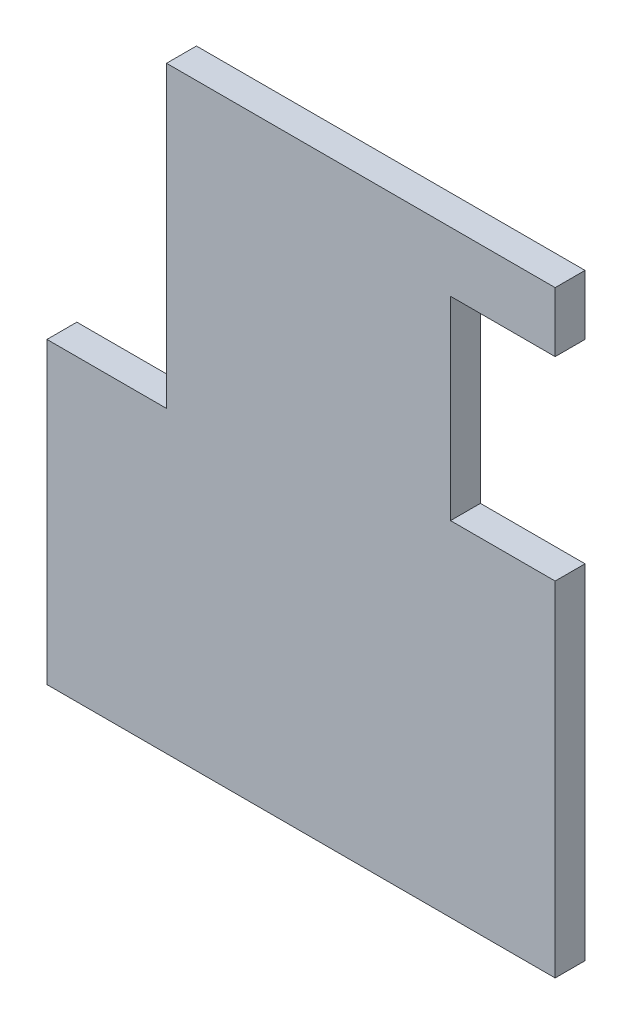
ISO-10303-21;
HEADER;
FILE_DESCRIPTION(('STEP AP214'),'2;1');
FILE_NAME('part.step','',(''),(''),'','','');
FILE_SCHEMA(('AUTOMOTIVE_DESIGN { 1 0 10303 214 1 1 1 1 }'));
ENDSEC;
DATA;
#1=APPLICATION_CONTEXT('core data for automotive mechanical design processes');
#2=APPLICATION_PROTOCOL_DEFINITION('international standard','automotive_design',2000,#1);
#3=PRODUCT_CONTEXT('',#1,'mechanical');
#4=PRODUCT('Part','Part','',(#3));
#5=PRODUCT_RELATED_PRODUCT_CATEGORY('part','',(#4));
#6=PRODUCT_DEFINITION_FORMATION('','',#4);
#7=PRODUCT_DEFINITION_CONTEXT('part definition',#1,'design');
#8=PRODUCT_DEFINITION('design','',#6,#7);
#9=PRODUCT_DEFINITION_SHAPE('','',#8);
#10=(LENGTH_UNIT() NAMED_UNIT(*) SI_UNIT(.MILLI.,.METRE.));
#11=(NAMED_UNIT(*) PLANE_ANGLE_UNIT() SI_UNIT($,.RADIAN.));
#12=(NAMED_UNIT(*) SI_UNIT($,.STERADIAN.) SOLID_ANGLE_UNIT());
#13=UNCERTAINTY_MEASURE_WITH_UNIT(LENGTH_MEASURE(1.E-05),#10,'distance_accuracy_value','');
#14=(GEOMETRIC_REPRESENTATION_CONTEXT(3) GLOBAL_UNCERTAINTY_ASSIGNED_CONTEXT((#13)) GLOBAL_UNIT_ASSIGNED_CONTEXT((#10,
#11,#12)) REPRESENTATION_CONTEXT('',''));
#15=CARTESIAN_POINT('',(0.,0.,0.));
#16=DIRECTION('',(0.,0.,1.));
#17=DIRECTION('',(1.,0.,0.));
#18=AXIS2_PLACEMENT_3D('',#15,#16,#17);
#19=CARTESIAN_POINT('',(-89.0927515243903,70.5572957317073,10.));
#20=DIRECTION('',(1.,0.,0.));
#21=DIRECTION('',(0.,1.,0.));
#22=AXIS2_PLACEMENT_3D('',#19,#20,#21);
#23=PLANE('',#22);
#24=DIRECTION('',(0.,-1.,0.));
#25=VECTOR('',#24,1.);
#26=CARTESIAN_POINT('',(-89.0927515243903,70.5572957317073,0.));
#27=LINE('',#26,#25);
#28=CARTESIAN_POINT('',(-89.0927515243903,70.5572957317073,0.));
#29=VERTEX_POINT('',#28);
#30=CARTESIAN_POINT('',(-89.0927515243903,-29.4427042682927,0.));
#31=VERTEX_POINT('',#30);
#32=EDGE_CURVE('E141',#29,#31,#27,.T.);
#33=ORIENTED_EDGE('',*,*,#32,.T.);
#34=DIRECTION('',(0.,0.,-1.));
#35=VECTOR('',#34,1.);
#36=CARTESIAN_POINT('',(-89.0927515243903,-29.4427042682927,10.));
#37=LINE('',#36,#35);
#38=CARTESIAN_POINT('',(-89.0927515243903,-29.4427042682927,10.));
#39=VERTEX_POINT('',#38);
#40=EDGE_CURVE('E11',#39,#31,#37,.T.);
#41=ORIENTED_EDGE('',*,*,#40,.F.);
#42=DIRECTION('',(0.,-1.,0.));
#43=VECTOR('',#42,1.);
#44=CARTESIAN_POINT('',(-89.0927515243903,70.5572957317073,10.));
#45=LINE('',#44,#43);
#46=CARTESIAN_POINT('',(-89.0927515243903,70.5572957317073,10.));
#47=VERTEX_POINT('',#46);
#48=EDGE_CURVE('E159',#47,#39,#45,.T.);
#49=ORIENTED_EDGE('',*,*,#48,.F.);
#50=DIRECTION('',(0.,0.,-1.));
#51=VECTOR('',#50,1.);
#52=CARTESIAN_POINT('',(-89.0927515243903,70.5572957317073,10.));
#53=LINE('',#52,#51);
#54=EDGE_CURVE('E137',#47,#29,#53,.T.);
#55=ORIENTED_EDGE('',*,*,#54,.T.);
#56=EDGE_LOOP('',(#33,#41,#49,#55));
#57=FACE_BOUND('',#56,.T.);
#58=ADVANCED_FACE('F33',(#57),#23,.F.);
#59=CARTESIAN_POINT('',(-89.0927515243903,-29.4427042682927,10.));
#60=DIRECTION('',(0.,1.,0.));
#61=DIRECTION('',(0.,0.,1.));
#62=AXIS2_PLACEMENT_3D('',#59,#60,#61);
#63=PLANE('',#62);
#64=DIRECTION('',(1.,0.,0.));
#65=VECTOR('',#64,1.);
#66=CARTESIAN_POINT('',(-89.0927515243903,-29.4427042682927,0.));
#67=LINE('',#66,#65);
#68=CARTESIAN_POINT('',(80.9072484756098,-29.4427042682927,0.));
#69=VERTEX_POINT('',#68);
#70=EDGE_CURVE('E144',#31,#69,#67,.T.);
#71=ORIENTED_EDGE('',*,*,#70,.T.);
#72=DIRECTION('',(0.,0.,-1.));
#73=VECTOR('',#72,1.);
#74=CARTESIAN_POINT('',(80.9072484756098,-29.4427042682927,10.));
#75=LINE('',#74,#73);
#76=CARTESIAN_POINT('',(80.9072484756098,-29.4427042682927,10.));
#77=VERTEX_POINT('',#76);
#78=EDGE_CURVE('E41',#77,#69,#75,.T.);
#79=ORIENTED_EDGE('',*,*,#78,.F.);
#80=DIRECTION('',(1.,0.,0.));
#81=VECTOR('',#80,1.);
#82=CARTESIAN_POINT('',(-89.0927515243903,-29.4427042682927,10.));
#83=LINE('',#82,#81);
#84=EDGE_CURVE('E98',#39,#77,#83,.T.);
#85=ORIENTED_EDGE('',*,*,#84,.F.);
#86=ORIENTED_EDGE('',*,*,#40,.T.);
#87=EDGE_LOOP('',(#71,#79,#85,#86));
#88=FACE_BOUND('',#87,.T.);
#89=ADVANCED_FACE('F208',(#88),#63,.F.);
#90=CARTESIAN_POINT('',(80.9072484756098,-29.4427042682927,10.));
#91=DIRECTION('',(-1.,0.,0.));
#92=DIRECTION('',(0.,0.,1.));
#93=AXIS2_PLACEMENT_3D('',#90,#91,#92);
#94=PLANE('',#93);
#95=DIRECTION('',(0.,1.,0.));
#96=VECTOR('',#95,1.);
#97=CARTESIAN_POINT('',(80.9072484756098,-29.4427042682927,0.));
#98=LINE('',#97,#96);
#99=CARTESIAN_POINT('',(80.9072484756098,85.5572957317073,0.));
#100=VERTEX_POINT('',#99);
#101=EDGE_CURVE('E146',#69,#100,#98,.T.);
#102=ORIENTED_EDGE('',*,*,#101,.T.);
#103=DIRECTION('',(0.,0.,-1.));
#104=VECTOR('',#103,1.);
#105=CARTESIAN_POINT('',(80.9072484756098,85.5572957317073,10.));
#106=LINE('',#105,#104);
#107=CARTESIAN_POINT('',(80.9072484756098,85.5572957317073,10.));
#108=VERTEX_POINT('',#107);
#109=EDGE_CURVE('E172',#108,#100,#106,.T.);
#110=ORIENTED_EDGE('',*,*,#109,.F.);
#111=DIRECTION('',(0.,1.,0.));
#112=VECTOR('',#111,1.);
#113=CARTESIAN_POINT('',(80.9072484756098,-29.4427042682927,10.));
#114=LINE('',#113,#112);
#115=EDGE_CURVE('E180',#77,#108,#114,.T.);
#116=ORIENTED_EDGE('',*,*,#115,.F.);
#117=ORIENTED_EDGE('',*,*,#78,.T.);
#118=EDGE_LOOP('',(#102,#110,#116,#117));
#119=FACE_BOUND('',#118,.T.);
#120=ADVANCED_FACE('F178',(#119),#94,.F.);
#121=CARTESIAN_POINT('',(45.9072484756098,85.5572957317073,10.));
#122=DIRECTION('',(0.,-1.,0.));
#123=DIRECTION('',(0.,0.,-1.));
#124=AXIS2_PLACEMENT_3D('',#121,#122,#123);
#125=PLANE('',#124);
#126=DIRECTION('',(-1.,0.,0.));
#127=VECTOR('',#126,1.);
#128=CARTESIAN_POINT('',(45.9072484756098,85.5572957317073,0.));
#129=LINE('',#128,#127);
#130=CARTESIAN_POINT('',(45.9072484756098,85.5572957317073,0.));
#131=VERTEX_POINT('',#130);
#132=EDGE_CURVE('E148',#100,#131,#129,.T.);
#133=ORIENTED_EDGE('',*,*,#132,.T.);
#134=DIRECTION('',(0.,0.,-1.));
#135=VECTOR('',#134,1.);
#136=CARTESIAN_POINT('',(45.9072484756098,85.5572957317073,10.));
#137=LINE('',#136,#135);
#138=CARTESIAN_POINT('',(45.9072484756098,85.5572957317073,10.));
#139=VERTEX_POINT('',#138);
#140=EDGE_CURVE('E169',#139,#131,#137,.T.);
#141=ORIENTED_EDGE('',*,*,#140,.F.);
#142=DIRECTION('',(-1.,0.,0.));
#143=VECTOR('',#142,1.);
#144=CARTESIAN_POINT('',(45.9072484756098,85.5572957317073,10.));
#145=LINE('',#144,#143);
#146=EDGE_CURVE('E198',#108,#139,#145,.T.);
#147=ORIENTED_EDGE('',*,*,#146,.F.);
#148=ORIENTED_EDGE('',*,*,#109,.T.);
#149=EDGE_LOOP('',(#133,#141,#147,#148));
#150=FACE_BOUND('',#149,.T.);
#151=ADVANCED_FACE('F189',(#150),#125,.F.);
#152=CARTESIAN_POINT('',(45.9072484756098,150.557295731707,10.));
#153=DIRECTION('',(-1.,0.,0.));
#154=DIRECTION('',(0.,0.,1.));
#155=AXIS2_PLACEMENT_3D('',#152,#153,#154);
#156=PLANE('',#155);
#157=DIRECTION('',(0.,1.,0.));
#158=VECTOR('',#157,1.);
#159=CARTESIAN_POINT('',(45.9072484756098,150.557295731707,0.));
#160=LINE('',#159,#158);
#161=CARTESIAN_POINT('',(45.9072484756098,150.557295731707,0.));
#162=VERTEX_POINT('',#161);
#163=EDGE_CURVE('E150',#131,#162,#160,.T.);
#164=ORIENTED_EDGE('',*,*,#163,.T.);
#165=DIRECTION('',(0.,0.,-1.));
#166=VECTOR('',#165,1.);
#167=CARTESIAN_POINT('',(45.9072484756098,150.557295731707,10.));
#168=LINE('',#167,#166);
#169=CARTESIAN_POINT('',(45.9072484756098,150.557295731707,10.));
#170=VERTEX_POINT('',#169);
#171=EDGE_CURVE('E166',#170,#162,#168,.T.);
#172=ORIENTED_EDGE('',*,*,#171,.F.);
#173=DIRECTION('',(0.,1.,0.));
#174=VECTOR('',#173,1.);
#175=CARTESIAN_POINT('',(45.9072484756098,150.557295731707,10.));
#176=LINE('',#175,#174);
#177=EDGE_CURVE('E195',#139,#170,#176,.T.);
#178=ORIENTED_EDGE('',*,*,#177,.F.);
#179=ORIENTED_EDGE('',*,*,#140,.T.);
#180=EDGE_LOOP('',(#164,#172,#178,#179));
#181=FACE_BOUND('',#180,.T.);
#182=ADVANCED_FACE('F193',(#181),#156,.F.);
#183=CARTESIAN_POINT('',(80.9072484756098,150.557295731707,10.));
#184=DIRECTION('',(0.,1.,0.));
#185=DIRECTION('',(0.,0.,1.));
#186=AXIS2_PLACEMENT_3D('',#183,#184,#185);
#187=PLANE('',#186);
#188=DIRECTION('',(1.,0.,0.));
#189=VECTOR('',#188,1.);
#190=CARTESIAN_POINT('',(80.9072484756098,150.557295731707,0.));
#191=LINE('',#190,#189);
#192=CARTESIAN_POINT('',(80.9072484756098,150.557295731707,0.));
#193=VERTEX_POINT('',#192);
#194=EDGE_CURVE('E152',#162,#193,#191,.T.);
#195=ORIENTED_EDGE('',*,*,#194,.T.);
#196=DIRECTION('',(0.,0.,-1.));
#197=VECTOR('',#196,1.);
#198=CARTESIAN_POINT('',(80.9072484756098,150.557295731707,10.));
#199=LINE('',#198,#197);
#200=CARTESIAN_POINT('',(80.9072484756098,150.557295731707,10.));
#201=VERTEX_POINT('',#200);
#202=EDGE_CURVE('E163',#201,#193,#199,.T.);
#203=ORIENTED_EDGE('',*,*,#202,.F.);
#204=DIRECTION('',(1.,0.,0.));
#205=VECTOR('',#204,1.);
#206=CARTESIAN_POINT('',(80.9072484756098,150.557295731707,10.));
#207=LINE('',#206,#205);
#208=EDGE_CURVE('E197',#170,#201,#207,.T.);
#209=ORIENTED_EDGE('',*,*,#208,.F.);
#210=ORIENTED_EDGE('',*,*,#171,.T.);
#211=EDGE_LOOP('',(#195,#203,#209,#210));
#212=FACE_BOUND('',#211,.T.);
#213=ADVANCED_FACE('F220',(#212),#187,.F.);
#214=CARTESIAN_POINT('',(80.9072484756098,150.557295731707,10.));
#215=DIRECTION('',(-1.,0.,0.));
#216=DIRECTION('',(0.,0.,1.));
#217=AXIS2_PLACEMENT_3D('',#214,#215,#216);
#218=PLANE('',#217);
#219=DIRECTION('',(0.,1.,0.));
#220=VECTOR('',#219,1.);
#221=CARTESIAN_POINT('',(80.9072484756098,150.557295731707,0.));
#222=LINE('',#221,#220);
#223=CARTESIAN_POINT('',(80.9072484756098,170.557295731707,0.));
#224=VERTEX_POINT('',#223);
#225=EDGE_CURVE('E154',#193,#224,#222,.T.);
#226=ORIENTED_EDGE('',*,*,#225,.T.);
#227=DIRECTION('',(0.,0.,-1.));
#228=VECTOR('',#227,1.);
#229=CARTESIAN_POINT('',(80.9072484756098,170.557295731707,10.));
#230=LINE('',#229,#228);
#231=CARTESIAN_POINT('',(80.9072484756098,170.557295731707,10.));
#232=VERTEX_POINT('',#231);
#233=EDGE_CURVE('E132',#232,#224,#230,.T.);
#234=ORIENTED_EDGE('',*,*,#233,.F.);
#235=DIRECTION('',(0.,1.,0.));
#236=VECTOR('',#235,1.);
#237=CARTESIAN_POINT('',(80.9072484756098,150.557295731707,10.));
#238=LINE('',#237,#236);
#239=EDGE_CURVE('E123',#201,#232,#238,.T.);
#240=ORIENTED_EDGE('',*,*,#239,.F.);
#241=ORIENTED_EDGE('',*,*,#202,.T.);
#242=EDGE_LOOP('',(#226,#234,#240,#241));
#243=FACE_BOUND('',#242,.T.);
#244=ADVANCED_FACE('F223',(#243),#218,.F.);
#245=CARTESIAN_POINT('',(80.9072484756098,170.557295731707,10.));
#246=DIRECTION('',(0.,-1.,0.));
#247=DIRECTION('',(0.,0.,-1.));
#248=AXIS2_PLACEMENT_3D('',#245,#246,#247);
#249=PLANE('',#248);
#250=DIRECTION('',(-1.,0.,0.));
#251=VECTOR('',#250,1.);
#252=CARTESIAN_POINT('',(80.9072484756098,170.557295731707,0.));
#253=LINE('',#252,#251);
#254=CARTESIAN_POINT('',(-49.0927515243903,170.557295731707,0.));
#255=VERTEX_POINT('',#254);
#256=EDGE_CURVE('E131',#224,#255,#253,.T.);
#257=ORIENTED_EDGE('',*,*,#256,.T.);
#258=DIRECTION('',(0.,0.,-1.));
#259=VECTOR('',#258,1.);
#260=CARTESIAN_POINT('',(-49.0927515243903,170.557295731707,10.));
#261=LINE('',#260,#259);
#262=CARTESIAN_POINT('',(-49.0927515243903,170.557295731707,10.));
#263=VERTEX_POINT('',#262);
#264=EDGE_CURVE('E128',#263,#255,#261,.T.);
#265=ORIENTED_EDGE('',*,*,#264,.F.);
#266=DIRECTION('',(-1.,0.,0.));
#267=VECTOR('',#266,1.);
#268=CARTESIAN_POINT('',(80.9072484756098,170.557295731707,10.));
#269=LINE('',#268,#267);
#270=EDGE_CURVE('E117',#232,#263,#269,.T.);
#271=ORIENTED_EDGE('',*,*,#270,.F.);
#272=ORIENTED_EDGE('',*,*,#233,.T.);
#273=EDGE_LOOP('',(#257,#265,#271,#272));
#274=FACE_BOUND('',#273,.T.);
#275=ADVANCED_FACE('F129',(#274),#249,.F.);
#276=CARTESIAN_POINT('',(-49.0927515243903,170.557295731707,10.));
#277=DIRECTION('',(1.,0.,0.));
#278=DIRECTION('',(0.,1.,0.));
#279=AXIS2_PLACEMENT_3D('',#276,#277,#278);
#280=PLANE('',#279);
#281=DIRECTION('',(0.,-1.,0.));
#282=VECTOR('',#281,1.);
#283=CARTESIAN_POINT('',(-49.0927515243903,170.557295731707,0.));
#284=LINE('',#283,#282);
#285=CARTESIAN_POINT('',(-49.0927515243903,70.5572957317073,0.));
#286=VERTEX_POINT('',#285);
#287=EDGE_CURVE('E84',#255,#286,#284,.T.);
#288=ORIENTED_EDGE('',*,*,#287,.T.);
#289=DIRECTION('',(0.,0.,-1.));
#290=VECTOR('',#289,1.);
#291=CARTESIAN_POINT('',(-49.0927515243903,70.5572957317073,10.));
#292=LINE('',#291,#290);
#293=CARTESIAN_POINT('',(-49.0927515243903,70.5572957317073,10.));
#294=VERTEX_POINT('',#293);
#295=EDGE_CURVE('E133',#294,#286,#292,.T.);
#296=ORIENTED_EDGE('',*,*,#295,.F.);
#297=DIRECTION('',(0.,-1.,0.));
#298=VECTOR('',#297,1.);
#299=CARTESIAN_POINT('',(-49.0927515243903,170.557295731707,10.));
#300=LINE('',#299,#298);
#301=EDGE_CURVE('E121',#263,#294,#300,.T.);
#302=ORIENTED_EDGE('',*,*,#301,.F.);
#303=ORIENTED_EDGE('',*,*,#264,.T.);
#304=EDGE_LOOP('',(#288,#296,#302,#303));
#305=FACE_BOUND('',#304,.T.);
#306=ADVANCED_FACE('F135',(#305),#280,.F.);
#307=CARTESIAN_POINT('',(-49.0927515243903,70.5572957317073,10.));
#308=DIRECTION('',(0.,-1.,0.));
#309=DIRECTION('',(1.,0.,0.));
#310=AXIS2_PLACEMENT_3D('',#307,#308,#309);
#311=PLANE('',#310);
#312=DIRECTION('',(-1.,0.,0.));
#313=VECTOR('',#312,1.);
#314=CARTESIAN_POINT('',(-49.0927515243903,70.5572957317073,0.));
#315=LINE('',#314,#313);
#316=EDGE_CURVE('E90',#286,#29,#315,.T.);
#317=ORIENTED_EDGE('',*,*,#316,.T.);
#318=ORIENTED_EDGE('',*,*,#54,.F.);
#319=DIRECTION('',(-1.,0.,0.));
#320=VECTOR('',#319,1.);
#321=CARTESIAN_POINT('',(-49.0927515243903,70.5572957317073,10.));
#322=LINE('',#321,#320);
#323=EDGE_CURVE('E49',#294,#47,#322,.T.);
#324=ORIENTED_EDGE('',*,*,#323,.F.);
#325=ORIENTED_EDGE('',*,*,#295,.T.);
#326=EDGE_LOOP('',(#317,#318,#324,#325));
#327=FACE_BOUND('',#326,.T.);
#328=ADVANCED_FACE('F232',(#327),#311,.F.);
#329=CARTESIAN_POINT('',(0.,0.,10.));
#330=DIRECTION('',(0.,0.,1.));
#331=DIRECTION('',(1.,0.,0.));
#332=AXIS2_PLACEMENT_3D('',#329,#330,#331);
#333=PLANE('',#332);
#334=ORIENTED_EDGE('',*,*,#48,.T.);
#335=ORIENTED_EDGE('',*,*,#84,.T.);
#336=ORIENTED_EDGE('',*,*,#115,.T.);
#337=ORIENTED_EDGE('',*,*,#146,.T.);
#338=ORIENTED_EDGE('',*,*,#177,.T.);
#339=ORIENTED_EDGE('',*,*,#208,.T.);
#340=ORIENTED_EDGE('',*,*,#239,.T.);
#341=ORIENTED_EDGE('',*,*,#270,.T.);
#342=ORIENTED_EDGE('',*,*,#301,.T.);
#343=ORIENTED_EDGE('',*,*,#323,.T.);
#344=EDGE_LOOP('',(#334,#335,#336,#337,#338,#339,#340,#341,#342,#343));
#345=FACE_BOUND('',#344,.T.);
#346=ADVANCED_FACE('F119',(#345),#333,.T.);
#347=CARTESIAN_POINT('',(0.,0.,0.));
#348=DIRECTION('',(0.,0.,1.));
#349=DIRECTION('',(1.,0.,0.));
#350=AXIS2_PLACEMENT_3D('',#347,#348,#349);
#351=PLANE('',#350);
#352=ORIENTED_EDGE('',*,*,#32,.F.);
#353=ORIENTED_EDGE('',*,*,#316,.F.);
#354=ORIENTED_EDGE('',*,*,#287,.F.);
#355=ORIENTED_EDGE('',*,*,#256,.F.);
#356=ORIENTED_EDGE('',*,*,#225,.F.);
#357=ORIENTED_EDGE('',*,*,#194,.F.);
#358=ORIENTED_EDGE('',*,*,#163,.F.);
#359=ORIENTED_EDGE('',*,*,#132,.F.);
#360=ORIENTED_EDGE('',*,*,#101,.F.);
#361=ORIENTED_EDGE('',*,*,#70,.F.);
#362=EDGE_LOOP('',(#352,#353,#354,#355,#356,#357,#358,#359,#360,#361));
#363=FACE_BOUND('',#362,.T.);
#364=ADVANCED_FACE('F184',(#363),#351,.F.);
#365=CLOSED_SHELL('',(#58,#89,#120,#151,#182,#213,#244,#275,#306,#328,#346,#364));
#366=MANIFOLD_SOLID_BREP('B2',#365);
#367=ADVANCED_BREP_SHAPE_REPRESENTATION('',(#18,#366),#14);
#368=SHAPE_DEFINITION_REPRESENTATION(#9,#367);
ENDSEC;
END-ISO-10303-21;
